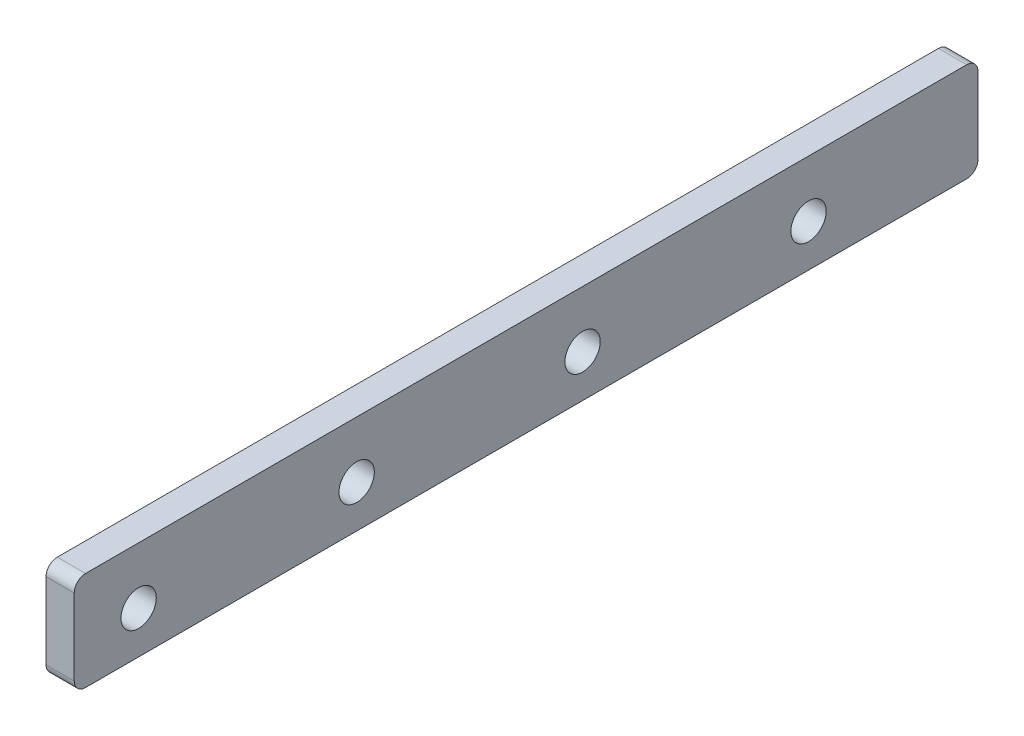
ISO-10303-21;
HEADER;
FILE_DESCRIPTION(('STEP AP214'),'2;1');
FILE_NAME('part.step','',(''),(''),'','','');
FILE_SCHEMA(('AUTOMOTIVE_DESIGN { 1 0 10303 214 1 1 1 1 }'));
ENDSEC;
DATA;
#1=APPLICATION_CONTEXT('core data for automotive mechanical design processes');
#2=APPLICATION_PROTOCOL_DEFINITION('international standard','automotive_design',2000,#1);
#3=PRODUCT_CONTEXT('',#1,'mechanical');
#4=PRODUCT('Part','Part','',(#3));
#5=PRODUCT_RELATED_PRODUCT_CATEGORY('part','',(#4));
#6=PRODUCT_DEFINITION_FORMATION('','',#4);
#7=PRODUCT_DEFINITION_CONTEXT('part definition',#1,'design');
#8=PRODUCT_DEFINITION('design','',#6,#7);
#9=PRODUCT_DEFINITION_SHAPE('','',#8);
#10=(LENGTH_UNIT() NAMED_UNIT(*) SI_UNIT(.MILLI.,.METRE.));
#11=(NAMED_UNIT(*) PLANE_ANGLE_UNIT() SI_UNIT($,.RADIAN.));
#12=(NAMED_UNIT(*) SI_UNIT($,.STERADIAN.) SOLID_ANGLE_UNIT());
#13=UNCERTAINTY_MEASURE_WITH_UNIT(LENGTH_MEASURE(1.E-05),#10,'distance_accuracy_value','');
#14=(GEOMETRIC_REPRESENTATION_CONTEXT(3) GLOBAL_UNCERTAINTY_ASSIGNED_CONTEXT((#13)) GLOBAL_UNIT_ASSIGNED_CONTEXT((#10,
#11,#12)) REPRESENTATION_CONTEXT('',''));
#15=CARTESIAN_POINT('',(0.,0.,0.));
#16=DIRECTION('',(0.,0.,1.));
#17=DIRECTION('',(1.,0.,0.));
#18=AXIS2_PLACEMENT_3D('',#15,#16,#17);
#19=CARTESIAN_POINT('',(6.35,0.,47.625));
#20=DIRECTION('',(0.,0.,-1.));
#21=DIRECTION('',(-1.,0.,0.));
#22=AXIS2_PLACEMENT_3D('',#19,#20,#21);
#23=PLANE('',#22);
#24=DIRECTION('',(0.,-1.,0.));
#25=VECTOR('',#24,1.);
#26=CARTESIAN_POINT('',(0.,0.,47.625));
#27=LINE('',#26,#25);
#28=CARTESIAN_POINT('',(0.,22.86,47.625));
#29=VERTEX_POINT('',#28);
#30=CARTESIAN_POINT('',(0.,5.715,47.625));
#31=VERTEX_POINT('',#30);
#32=EDGE_CURVE('E138',#29,#31,#27,.T.);
#33=ORIENTED_EDGE('',*,*,#32,.T.);
#34=DIRECTION('',(-1.,0.,0.));
#35=VECTOR('',#34,1.);
#36=CARTESIAN_POINT('',(6.35,5.715,47.625));
#37=LINE('',#36,#35);
#38=CARTESIAN_POINT('',(6.35,5.715,47.625));
#39=VERTEX_POINT('',#38);
#40=EDGE_CURVE('E112',#31,#39,#37,.F.);
#41=ORIENTED_EDGE('',*,*,#40,.T.);
#42=DIRECTION('',(0.,-1.,0.));
#43=VECTOR('',#42,1.);
#44=CARTESIAN_POINT('',(6.35,0.,47.625));
#45=LINE('',#44,#43);
#46=CARTESIAN_POINT('',(6.35,22.86,47.625));
#47=VERTEX_POINT('',#46);
#48=EDGE_CURVE('E210',#47,#39,#45,.T.);
#49=ORIENTED_EDGE('',*,*,#48,.F.);
#50=DIRECTION('',(-1.,0.,0.));
#51=VECTOR('',#50,1.);
#52=CARTESIAN_POINT('',(6.35,22.86,47.625));
#53=LINE('',#52,#51);
#54=EDGE_CURVE('E118',#47,#29,#53,.T.);
#55=ORIENTED_EDGE('',*,*,#54,.T.);
#56=EDGE_LOOP('',(#33,#41,#49,#55));
#57=FACE_BOUND('',#56,.T.);
#58=ADVANCED_FACE('F41',(#57),#23,.F.);
#59=CARTESIAN_POINT('',(6.35,3.175,0.));
#60=DIRECTION('',(0.,1.,0.));
#61=DIRECTION('',(0.,0.,1.));
#62=AXIS2_PLACEMENT_3D('',#59,#60,#61);
#63=PLANE('',#62);
#64=DIRECTION('',(0.,0.,-1.));
#65=VECTOR('',#64,1.);
#66=CARTESIAN_POINT('',(6.35,3.175,0.));
#67=LINE('',#66,#65);
#68=CARTESIAN_POINT('',(6.35,3.175,45.085));
#69=VERTEX_POINT('',#68);
#70=CARTESIAN_POINT('',(6.35,3.175,-153.035));
#71=VERTEX_POINT('',#70);
#72=EDGE_CURVE('E128',#69,#71,#67,.T.);
#73=ORIENTED_EDGE('',*,*,#72,.F.);
#74=DIRECTION('',(-1.,0.,0.));
#75=VECTOR('',#74,1.);
#76=CARTESIAN_POINT('',(6.35,3.175,45.085));
#77=LINE('',#76,#75);
#78=CARTESIAN_POINT('',(0.,3.175,45.085));
#79=VERTEX_POINT('',#78);
#80=EDGE_CURVE('E111',#69,#79,#77,.T.);
#81=ORIENTED_EDGE('',*,*,#80,.T.);
#82=DIRECTION('',(0.,0.,-1.));
#83=VECTOR('',#82,1.);
#84=CARTESIAN_POINT('',(0.,3.175,0.));
#85=LINE('',#84,#83);
#86=CARTESIAN_POINT('',(0.,3.175,-153.035));
#87=VERTEX_POINT('',#86);
#88=EDGE_CURVE('E125',#79,#87,#85,.T.);
#89=ORIENTED_EDGE('',*,*,#88,.T.);
#90=DIRECTION('',(-1.,0.,0.));
#91=VECTOR('',#90,1.);
#92=CARTESIAN_POINT('',(6.35,3.175,-153.035));
#93=LINE('',#92,#91);
#94=EDGE_CURVE('E131',#87,#71,#93,.F.);
#95=ORIENTED_EDGE('',*,*,#94,.T.);
#96=EDGE_LOOP('',(#73,#81,#89,#95));
#97=FACE_BOUND('',#96,.T.);
#98=ADVANCED_FACE('F124',(#97),#63,.F.);
#99=CARTESIAN_POINT('',(6.35,0.,-155.575));
#100=DIRECTION('',(0.,0.,1.));
#101=DIRECTION('',(1.,0.,0.));
#102=AXIS2_PLACEMENT_3D('',#99,#100,#101);
#103=PLANE('',#102);
#104=DIRECTION('',(0.,1.,0.));
#105=VECTOR('',#104,1.);
#106=CARTESIAN_POINT('',(6.35,0.,-155.575));
#107=LINE('',#106,#105);
#108=CARTESIAN_POINT('',(6.35,5.715,-155.575));
#109=VERTEX_POINT('',#108);
#110=CARTESIAN_POINT('',(6.35,22.86,-155.575));
#111=VERTEX_POINT('',#110);
#112=EDGE_CURVE('E215',#109,#111,#107,.T.);
#113=ORIENTED_EDGE('',*,*,#112,.F.);
#114=DIRECTION('',(-1.,0.,0.));
#115=VECTOR('',#114,1.);
#116=CARTESIAN_POINT('',(6.35,5.715,-155.575));
#117=LINE('',#116,#115);
#118=CARTESIAN_POINT('',(0.,5.715,-155.575));
#119=VERTEX_POINT('',#118);
#120=EDGE_CURVE('E193',#109,#119,#117,.T.);
#121=ORIENTED_EDGE('',*,*,#120,.T.);
#122=DIRECTION('',(0.,1.,0.));
#123=VECTOR('',#122,1.);
#124=CARTESIAN_POINT('',(0.,0.,-155.575));
#125=LINE('',#124,#123);
#126=CARTESIAN_POINT('',(0.,22.86,-155.575));
#127=VERTEX_POINT('',#126);
#128=EDGE_CURVE('E137',#119,#127,#125,.T.);
#129=ORIENTED_EDGE('',*,*,#128,.T.);
#130=DIRECTION('',(-1.,0.,0.));
#131=VECTOR('',#130,1.);
#132=CARTESIAN_POINT('',(6.35,22.86,-155.575));
#133=LINE('',#132,#131);
#134=EDGE_CURVE('E190',#127,#111,#133,.F.);
#135=ORIENTED_EDGE('',*,*,#134,.T.);
#136=EDGE_LOOP('',(#113,#121,#129,#135));
#137=FACE_BOUND('',#136,.T.);
#138=ADVANCED_FACE('F259',(#137),#103,.F.);
#139=CARTESIAN_POINT('',(6.35,12.7,-66.675));
#140=DIRECTION('',(-1.,0.,0.));
#141=DIRECTION('',(0.,0.,1.));
#142=AXIS2_PLACEMENT_3D('',#139,#140,#141);
#143=CYLINDRICAL_SURFACE('',#142,3.96874999999999);
#144=CARTESIAN_POINT('',(6.35,12.7,-66.675));
#145=DIRECTION('',(1.,0.,0.));
#146=DIRECTION('',(0.,0.,-1.));
#147=AXIS2_PLACEMENT_3D('',#144,#145,#146);
#148=CIRCLE('',#147,3.96874999999999);
#149=CARTESIAN_POINT('',(6.35,12.7,-70.64375));
#150=VERTEX_POINT('',#149);
#151=EDGE_CURVE('E228',#150,#150,#148,.T.);
#152=ORIENTED_EDGE('',*,*,#151,.T.);
#153=EDGE_LOOP('',(#152));
#154=FACE_BOUND('',#153,.T.);
#155=CARTESIAN_POINT('',(0.,12.7,-66.675));
#156=DIRECTION('',(1.,0.,0.));
#157=DIRECTION('',(0.,0.,-1.));
#158=AXIS2_PLACEMENT_3D('',#155,#156,#157);
#159=CIRCLE('',#158,3.96874999999999);
#160=CARTESIAN_POINT('',(0.,12.7,-70.64375));
#161=VERTEX_POINT('',#160);
#162=EDGE_CURVE('E155',#161,#161,#159,.T.);
#163=ORIENTED_EDGE('',*,*,#162,.F.);
#164=EDGE_LOOP('',(#163));
#165=FACE_BOUND('',#164,.T.);
#166=ADVANCED_FACE('F263',(#154,#165),#143,.F.);
#167=CARTESIAN_POINT('',(6.35,12.7,-117.475));
#168=DIRECTION('',(-1.,0.,0.));
#169=DIRECTION('',(0.,0.,1.));
#170=AXIS2_PLACEMENT_3D('',#167,#168,#169);
#171=CYLINDRICAL_SURFACE('',#170,3.96875);
#172=CARTESIAN_POINT('',(6.35,12.7,-117.475));
#173=DIRECTION('',(1.,0.,0.));
#174=DIRECTION('',(0.,0.,-1.));
#175=AXIS2_PLACEMENT_3D('',#172,#173,#174);
#176=CIRCLE('',#175,3.96875);
#177=CARTESIAN_POINT('',(6.35,12.7,-121.44375));
#178=VERTEX_POINT('',#177);
#179=EDGE_CURVE('E224',#178,#178,#176,.T.);
#180=ORIENTED_EDGE('',*,*,#179,.T.);
#181=EDGE_LOOP('',(#180));
#182=FACE_BOUND('',#181,.T.);
#183=CARTESIAN_POINT('',(0.,12.7,-117.475));
#184=DIRECTION('',(1.,0.,0.));
#185=DIRECTION('',(0.,0.,-1.));
#186=AXIS2_PLACEMENT_3D('',#183,#184,#185);
#187=CIRCLE('',#186,3.96875);
#188=CARTESIAN_POINT('',(0.,12.7,-121.44375));
#189=VERTEX_POINT('',#188);
#190=EDGE_CURVE('E151',#189,#189,#187,.T.);
#191=ORIENTED_EDGE('',*,*,#190,.F.);
#192=EDGE_LOOP('',(#191));
#193=FACE_BOUND('',#192,.T.);
#194=ADVANCED_FACE('F251',(#182,#193),#171,.F.);
#195=CARTESIAN_POINT('',(6.35,25.4,0.));
#196=DIRECTION('',(0.,-1.,0.));
#197=DIRECTION('',(0.,0.,-1.));
#198=AXIS2_PLACEMENT_3D('',#195,#196,#197);
#199=PLANE('',#198);
#200=DIRECTION('',(0.,0.,1.));
#201=VECTOR('',#200,1.);
#202=CARTESIAN_POINT('',(0.,25.4,0.));
#203=LINE('',#202,#201);
#204=CARTESIAN_POINT('',(0.,25.4,-153.035));
#205=VERTEX_POINT('',#204);
#206=CARTESIAN_POINT('',(0.,25.4,45.085));
#207=VERTEX_POINT('',#206);
#208=EDGE_CURVE('E143',#205,#207,#203,.T.);
#209=ORIENTED_EDGE('',*,*,#208,.T.);
#210=DIRECTION('',(-1.,0.,0.));
#211=VECTOR('',#210,1.);
#212=CARTESIAN_POINT('',(6.35,25.4,45.085));
#213=LINE('',#212,#211);
#214=CARTESIAN_POINT('',(6.35,25.4,45.085));
#215=VERTEX_POINT('',#214);
#216=EDGE_CURVE('E11',#207,#215,#213,.F.);
#217=ORIENTED_EDGE('',*,*,#216,.T.);
#218=DIRECTION('',(0.,0.,1.));
#219=VECTOR('',#218,1.);
#220=CARTESIAN_POINT('',(6.35,25.4,0.));
#221=LINE('',#220,#219);
#222=CARTESIAN_POINT('',(6.35,25.4,-153.035));
#223=VERTEX_POINT('',#222);
#224=EDGE_CURVE('E201',#223,#215,#221,.T.);
#225=ORIENTED_EDGE('',*,*,#224,.F.);
#226=DIRECTION('',(-1.,0.,0.));
#227=VECTOR('',#226,1.);
#228=CARTESIAN_POINT('',(6.35,25.4,-153.035));
#229=LINE('',#228,#227);
#230=EDGE_CURVE('E50',#223,#205,#229,.T.);
#231=ORIENTED_EDGE('',*,*,#230,.T.);
#232=EDGE_LOOP('',(#209,#217,#225,#231));
#233=FACE_BOUND('',#232,.T.);
#234=ADVANCED_FACE('F200',(#233),#199,.F.);
#235=CARTESIAN_POINT('',(6.35,12.7,33.147));
#236=DIRECTION('',(-1.,0.,0.));
#237=DIRECTION('',(0.,0.,1.));
#238=AXIS2_PLACEMENT_3D('',#235,#236,#237);
#239=CYLINDRICAL_SURFACE('',#238,3.96875);
#240=CARTESIAN_POINT('',(6.35,12.7,33.147));
#241=DIRECTION('',(1.,0.,0.));
#242=DIRECTION('',(0.,0.,-1.));
#243=AXIS2_PLACEMENT_3D('',#240,#241,#242);
#244=CIRCLE('',#243,3.96875);
#245=CARTESIAN_POINT('',(6.35,12.7,29.17825));
#246=VERTEX_POINT('',#245);
#247=EDGE_CURVE('E163',#246,#246,#244,.T.);
#248=ORIENTED_EDGE('',*,*,#247,.T.);
#249=EDGE_LOOP('',(#248));
#250=FACE_BOUND('',#249,.T.);
#251=CARTESIAN_POINT('',(0.,12.7,33.147));
#252=DIRECTION('',(1.,0.,0.));
#253=DIRECTION('',(0.,0.,-1.));
#254=AXIS2_PLACEMENT_3D('',#251,#252,#253);
#255=CIRCLE('',#254,3.96875);
#256=CARTESIAN_POINT('',(0.,12.7,29.17825));
#257=VERTEX_POINT('',#256);
#258=EDGE_CURVE('E145',#257,#257,#255,.T.);
#259=ORIENTED_EDGE('',*,*,#258,.F.);
#260=EDGE_LOOP('',(#259));
#261=FACE_BOUND('',#260,.T.);
#262=ADVANCED_FACE('F239',(#250,#261),#239,.F.);
#263=CARTESIAN_POINT('',(6.35,12.7,-15.875));
#264=DIRECTION('',(-1.,0.,0.));
#265=DIRECTION('',(0.,0.,1.));
#266=AXIS2_PLACEMENT_3D('',#263,#264,#265);
#267=CYLINDRICAL_SURFACE('',#266,3.96875);
#268=CARTESIAN_POINT('',(6.35,12.7,-15.875));
#269=DIRECTION('',(1.,0.,0.));
#270=DIRECTION('',(0.,0.,-1.));
#271=AXIS2_PLACEMENT_3D('',#268,#269,#270);
#272=CIRCLE('',#271,3.96875);
#273=CARTESIAN_POINT('',(6.35,12.7,-19.84375));
#274=VERTEX_POINT('',#273);
#275=EDGE_CURVE('E165',#274,#274,#272,.T.);
#276=ORIENTED_EDGE('',*,*,#275,.T.);
#277=EDGE_LOOP('',(#276));
#278=FACE_BOUND('',#277,.T.);
#279=CARTESIAN_POINT('',(0.,12.7,-15.875));
#280=DIRECTION('',(1.,0.,0.));
#281=DIRECTION('',(0.,0.,-1.));
#282=AXIS2_PLACEMENT_3D('',#279,#280,#281);
#283=CIRCLE('',#282,3.96875);
#284=CARTESIAN_POINT('',(0.,12.7,-19.84375));
#285=VERTEX_POINT('',#284);
#286=EDGE_CURVE('E159',#285,#285,#283,.T.);
#287=ORIENTED_EDGE('',*,*,#286,.F.);
#288=EDGE_LOOP('',(#287));
#289=FACE_BOUND('',#288,.T.);
#290=ADVANCED_FACE('F241',(#278,#289),#267,.F.);
#291=CARTESIAN_POINT('',(6.35,0.,0.));
#292=DIRECTION('',(1.,0.,0.));
#293=DIRECTION('',(0.,0.,-1.));
#294=AXIS2_PLACEMENT_3D('',#291,#292,#293);
#295=PLANE('',#294);
#296=ORIENTED_EDGE('',*,*,#247,.F.);
#297=EDGE_LOOP('',(#296));
#298=FACE_BOUND('',#297,.T.);
#299=ORIENTED_EDGE('',*,*,#48,.T.);
#300=CARTESIAN_POINT('',(6.35,5.715,45.085));
#301=DIRECTION('',(1.,0.,0.));
#302=DIRECTION('',(0.,0.,-1.));
#303=AXIS2_PLACEMENT_3D('',#300,#301,#302);
#304=CIRCLE('',#303,2.54);
#305=EDGE_CURVE('E187',#39,#69,#304,.T.);
#306=ORIENTED_EDGE('',*,*,#305,.T.);
#307=ORIENTED_EDGE('',*,*,#72,.T.);
#308=CARTESIAN_POINT('',(6.35,5.715,-153.035));
#309=DIRECTION('',(1.,0.,0.));
#310=DIRECTION('',(0.,0.,-1.));
#311=AXIS2_PLACEMENT_3D('',#308,#309,#310);
#312=CIRCLE('',#311,2.54);
#313=EDGE_CURVE('E184',#71,#109,#312,.T.);
#314=ORIENTED_EDGE('',*,*,#313,.T.);
#315=ORIENTED_EDGE('',*,*,#112,.T.);
#316=CARTESIAN_POINT('',(6.35,22.86,-153.035));
#317=DIRECTION('',(1.,0.,0.));
#318=DIRECTION('',(0.,0.,-1.));
#319=AXIS2_PLACEMENT_3D('',#316,#317,#318);
#320=CIRCLE('',#319,2.54);
#321=EDGE_CURVE('E62',#111,#223,#320,.T.);
#322=ORIENTED_EDGE('',*,*,#321,.T.);
#323=ORIENTED_EDGE('',*,*,#224,.T.);
#324=CARTESIAN_POINT('',(6.35,22.86,45.085));
#325=DIRECTION('',(1.,0.,0.));
#326=DIRECTION('',(0.,0.,-1.));
#327=AXIS2_PLACEMENT_3D('',#324,#325,#326);
#328=CIRCLE('',#327,2.54);
#329=EDGE_CURVE('E181',#215,#47,#328,.T.);
#330=ORIENTED_EDGE('',*,*,#329,.T.);
#331=EDGE_LOOP('',(#299,#306,#307,#314,#315,#322,#323,#330));
#332=FACE_BOUND('',#331,.T.);
#333=ORIENTED_EDGE('',*,*,#179,.F.);
#334=EDGE_LOOP('',(#333));
#335=FACE_BOUND('',#334,.T.);
#336=ORIENTED_EDGE('',*,*,#151,.F.);
#337=EDGE_LOOP('',(#336));
#338=FACE_BOUND('',#337,.T.);
#339=ORIENTED_EDGE('',*,*,#275,.F.);
#340=EDGE_LOOP('',(#339));
#341=FACE_BOUND('',#340,.T.);
#342=ADVANCED_FACE('F248',(#298,#332,#335,#338,#341),#295,.T.);
#343=CARTESIAN_POINT('',(0.,0.,0.));
#344=DIRECTION('',(1.,0.,0.));
#345=DIRECTION('',(0.,0.,-1.));
#346=AXIS2_PLACEMENT_3D('',#343,#344,#345);
#347=PLANE('',#346);
#348=ORIENTED_EDGE('',*,*,#258,.T.);
#349=EDGE_LOOP('',(#348));
#350=FACE_BOUND('',#349,.T.);
#351=ORIENTED_EDGE('',*,*,#88,.F.);
#352=CARTESIAN_POINT('',(0.,5.715,45.085));
#353=DIRECTION('',(1.,0.,0.));
#354=DIRECTION('',(0.,0.,-1.));
#355=AXIS2_PLACEMENT_3D('',#352,#353,#354);
#356=CIRCLE('',#355,2.54);
#357=EDGE_CURVE('E107',#79,#31,#356,.F.);
#358=ORIENTED_EDGE('',*,*,#357,.T.);
#359=ORIENTED_EDGE('',*,*,#32,.F.);
#360=CARTESIAN_POINT('',(0.,22.86,45.085));
#361=DIRECTION('',(1.,0.,0.));
#362=DIRECTION('',(0.,0.,-1.));
#363=AXIS2_PLACEMENT_3D('',#360,#361,#362);
#364=CIRCLE('',#363,2.54);
#365=EDGE_CURVE('E169',#29,#207,#364,.F.);
#366=ORIENTED_EDGE('',*,*,#365,.T.);
#367=ORIENTED_EDGE('',*,*,#208,.F.);
#368=CARTESIAN_POINT('',(0.,22.86,-153.035));
#369=DIRECTION('',(1.,0.,0.));
#370=DIRECTION('',(0.,0.,-1.));
#371=AXIS2_PLACEMENT_3D('',#368,#369,#370);
#372=CIRCLE('',#371,2.54);
#373=EDGE_CURVE('E130',#205,#127,#372,.F.);
#374=ORIENTED_EDGE('',*,*,#373,.T.);
#375=ORIENTED_EDGE('',*,*,#128,.F.);
#376=CARTESIAN_POINT('',(0.,5.715,-153.035));
#377=DIRECTION('',(1.,0.,0.));
#378=DIRECTION('',(0.,0.,-1.));
#379=AXIS2_PLACEMENT_3D('',#376,#377,#378);
#380=CIRCLE('',#379,2.54);
#381=EDGE_CURVE('E119',#119,#87,#380,.F.);
#382=ORIENTED_EDGE('',*,*,#381,.T.);
#383=EDGE_LOOP('',(#351,#358,#359,#366,#367,#374,#375,#382));
#384=FACE_BOUND('',#383,.T.);
#385=ORIENTED_EDGE('',*,*,#190,.T.);
#386=EDGE_LOOP('',(#385));
#387=FACE_BOUND('',#386,.T.);
#388=ORIENTED_EDGE('',*,*,#162,.T.);
#389=EDGE_LOOP('',(#388));
#390=FACE_BOUND('',#389,.T.);
#391=ORIENTED_EDGE('',*,*,#286,.T.);
#392=EDGE_LOOP('',(#391));
#393=FACE_BOUND('',#392,.T.);
#394=ADVANCED_FACE('F133',(#350,#384,#387,#390,#393),#347,.F.);
#395=CARTESIAN_POINT('',(6.35,5.715,45.085));
#396=DIRECTION('',(-1.,0.,0.));
#397=DIRECTION('',(0.,0.,1.));
#398=AXIS2_PLACEMENT_3D('',#395,#396,#397);
#399=CYLINDRICAL_SURFACE('',#398,2.54);
#400=ORIENTED_EDGE('',*,*,#305,.F.);
#401=ORIENTED_EDGE('',*,*,#40,.F.);
#402=ORIENTED_EDGE('',*,*,#357,.F.);
#403=ORIENTED_EDGE('',*,*,#80,.F.);
#404=EDGE_LOOP('',(#400,#401,#402,#403));
#405=FACE_BOUND('',#404,.T.);
#406=ADVANCED_FACE('F110',(#405),#399,.T.);
#407=CARTESIAN_POINT('',(6.35,5.715,-153.035));
#408=DIRECTION('',(-1.,0.,0.));
#409=DIRECTION('',(0.,0.,1.));
#410=AXIS2_PLACEMENT_3D('',#407,#408,#409);
#411=CYLINDRICAL_SURFACE('',#410,2.54);
#412=ORIENTED_EDGE('',*,*,#313,.F.);
#413=ORIENTED_EDGE('',*,*,#94,.F.);
#414=ORIENTED_EDGE('',*,*,#381,.F.);
#415=ORIENTED_EDGE('',*,*,#120,.F.);
#416=EDGE_LOOP('',(#412,#413,#414,#415));
#417=FACE_BOUND('',#416,.T.);
#418=ADVANCED_FACE('F306',(#417),#411,.T.);
#419=CARTESIAN_POINT('',(6.35,22.86,45.085));
#420=DIRECTION('',(-1.,0.,0.));
#421=DIRECTION('',(0.,0.,1.));
#422=AXIS2_PLACEMENT_3D('',#419,#420,#421);
#423=CYLINDRICAL_SURFACE('',#422,2.54);
#424=ORIENTED_EDGE('',*,*,#329,.F.);
#425=ORIENTED_EDGE('',*,*,#216,.F.);
#426=ORIENTED_EDGE('',*,*,#365,.F.);
#427=ORIENTED_EDGE('',*,*,#54,.F.);
#428=EDGE_LOOP('',(#424,#425,#426,#427));
#429=FACE_BOUND('',#428,.T.);
#430=ADVANCED_FACE('F206',(#429),#423,.T.);
#431=CARTESIAN_POINT('',(6.35,22.86,-153.035));
#432=DIRECTION('',(-1.,0.,0.));
#433=DIRECTION('',(0.,0.,1.));
#434=AXIS2_PLACEMENT_3D('',#431,#432,#433);
#435=CYLINDRICAL_SURFACE('',#434,2.54);
#436=ORIENTED_EDGE('',*,*,#321,.F.);
#437=ORIENTED_EDGE('',*,*,#134,.F.);
#438=ORIENTED_EDGE('',*,*,#373,.F.);
#439=ORIENTED_EDGE('',*,*,#230,.F.);
#440=EDGE_LOOP('',(#436,#437,#438,#439));
#441=FACE_BOUND('',#440,.T.);
#442=ADVANCED_FACE('F43',(#441),#435,.T.);
#443=CLOSED_SHELL('',(#58,#98,#138,#166,#194,#234,#262,#290,#342,#394,#406,#418,#430,#442));
#444=MANIFOLD_SOLID_BREP('B2',#443);
#445=ADVANCED_BREP_SHAPE_REPRESENTATION('',(#18,#444),#14);
#446=SHAPE_DEFINITION_REPRESENTATION(#9,#445);
ENDSEC;
END-ISO-10303-21;
